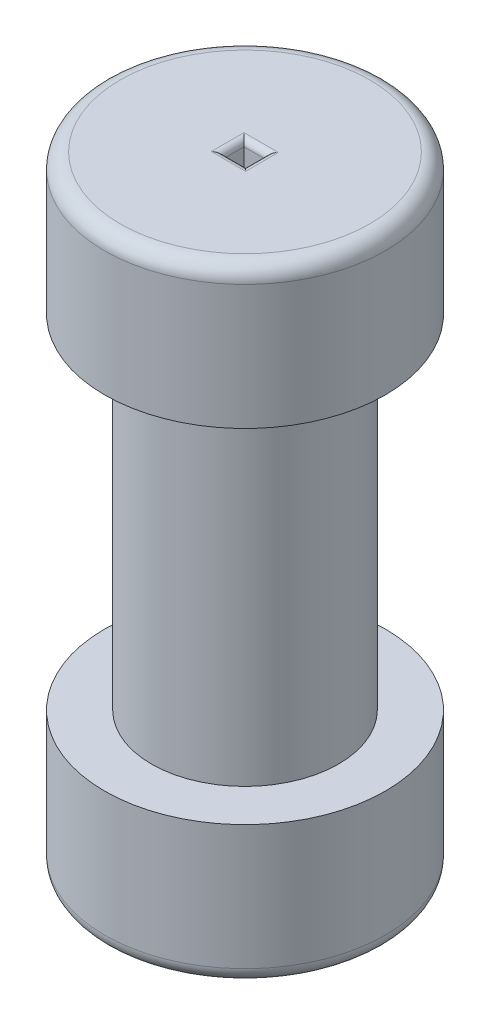
ISO-10303-21;
HEADER;
FILE_DESCRIPTION(('STEP AP214'),'2;1');
FILE_NAME('part.step','',(''),(''),'','','');
FILE_SCHEMA(('AUTOMOTIVE_DESIGN { 1 0 10303 214 1 1 1 1 }'));
ENDSEC;
DATA;
#1=APPLICATION_CONTEXT('core data for automotive mechanical design processes');
#2=APPLICATION_PROTOCOL_DEFINITION('international standard','automotive_design',2000,#1);
#3=PRODUCT_CONTEXT('',#1,'mechanical');
#4=PRODUCT('Part','Part','',(#3));
#5=PRODUCT_RELATED_PRODUCT_CATEGORY('part','',(#4));
#6=PRODUCT_DEFINITION_FORMATION('','',#4);
#7=PRODUCT_DEFINITION_CONTEXT('part definition',#1,'design');
#8=PRODUCT_DEFINITION('design','',#6,#7);
#9=PRODUCT_DEFINITION_SHAPE('','',#8);
#10=(LENGTH_UNIT() NAMED_UNIT(*) SI_UNIT(.MILLI.,.METRE.));
#11=(NAMED_UNIT(*) PLANE_ANGLE_UNIT() SI_UNIT($,.RADIAN.));
#12=(NAMED_UNIT(*) SI_UNIT($,.STERADIAN.) SOLID_ANGLE_UNIT());
#13=UNCERTAINTY_MEASURE_WITH_UNIT(LENGTH_MEASURE(1.E-05),#10,'distance_accuracy_value','');
#14=(GEOMETRIC_REPRESENTATION_CONTEXT(3) GLOBAL_UNCERTAINTY_ASSIGNED_CONTEXT((#13)) GLOBAL_UNIT_ASSIGNED_CONTEXT((#10,
#11,#12)) REPRESENTATION_CONTEXT('',''));
#15=CARTESIAN_POINT('',(0.,0.,0.));
#16=DIRECTION('',(0.,0.,1.));
#17=DIRECTION('',(1.,0.,0.));
#18=AXIS2_PLACEMENT_3D('',#15,#16,#17);
#19=CARTESIAN_POINT('',(0.,22.86,0.));
#20=DIRECTION('',(0.,-1.,0.));
#21=DIRECTION('',(0.,0.,-1.));
#22=AXIS2_PLACEMENT_3D('',#19,#20,#21);
#23=CYLINDRICAL_SURFACE('',#22,22.86);
#24=CARTESIAN_POINT('',(0.,2.54,0.));
#25=DIRECTION('',(0.,1.,0.));
#26=DIRECTION('',(0.,0.,1.));
#27=AXIS2_PLACEMENT_3D('',#24,#25,#26);
#28=CIRCLE('',#27,22.86);
#29=CARTESIAN_POINT('',(0.,2.54,22.86));
#30=VERTEX_POINT('',#29);
#31=EDGE_CURVE('E219',#30,#30,#28,.T.);
#32=ORIENTED_EDGE('',*,*,#31,.T.);
#33=EDGE_LOOP('',(#32));
#34=FACE_BOUND('',#33,.T.);
#35=CARTESIAN_POINT('',(0.,22.86,0.));
#36=DIRECTION('',(0.,1.,0.));
#37=DIRECTION('',(0.,0.,1.));
#38=AXIS2_PLACEMENT_3D('',#35,#36,#37);
#39=CIRCLE('',#38,22.86);
#40=CARTESIAN_POINT('',(0.,22.86,22.86));
#41=VERTEX_POINT('',#40);
#42=EDGE_CURVE('E224',#41,#41,#39,.T.);
#43=ORIENTED_EDGE('',*,*,#42,.F.);
#44=EDGE_LOOP('',(#43));
#45=FACE_BOUND('',#44,.T.);
#46=ADVANCED_FACE('F45',(#34,#45),#23,.T.);
#47=CARTESIAN_POINT('',(0.,22.86,0.));
#48=DIRECTION('',(0.,1.,0.));
#49=DIRECTION('',(0.,0.,1.));
#50=AXIS2_PLACEMENT_3D('',#47,#48,#49);
#51=PLANE('',#50);
#52=CARTESIAN_POINT('',(0.,22.86,0.));
#53=DIRECTION('',(0.,1.,0.));
#54=DIRECTION('',(0.,0.,1.));
#55=AXIS2_PLACEMENT_3D('',#52,#53,#54);
#56=CIRCLE('',#55,15.24);
#57=CARTESIAN_POINT('',(0.,22.86,15.24));
#58=VERTEX_POINT('',#57);
#59=EDGE_CURVE('E223',#58,#58,#56,.T.);
#60=ORIENTED_EDGE('',*,*,#59,.F.);
#61=EDGE_LOOP('',(#60));
#62=FACE_BOUND('',#61,.T.);
#63=ORIENTED_EDGE('',*,*,#42,.T.);
#64=EDGE_LOOP('',(#63));
#65=FACE_BOUND('',#64,.T.);
#66=ADVANCED_FACE('F285',(#62,#65),#51,.T.);
#67=CARTESIAN_POINT('',(0.,0.,0.));
#68=DIRECTION('',(0.,1.,0.));
#69=DIRECTION('',(0.,0.,1.));
#70=AXIS2_PLACEMENT_3D('',#67,#68,#69);
#71=PLANE('',#70);
#72=DIRECTION('',(0.,0.,1.));
#73=VECTOR('',#72,1.);
#74=CARTESIAN_POINT('',(-2.8,0.,0.));
#75=LINE('',#74,#73);
#76=CARTESIAN_POINT('',(-2.8,0.,-2.64));
#77=VERTEX_POINT('',#76);
#78=CARTESIAN_POINT('',(-2.8,0.,2.7));
#79=VERTEX_POINT('',#78);
#80=EDGE_CURVE('E125',#77,#79,#75,.T.);
#81=ORIENTED_EDGE('',*,*,#80,.T.);
#82=DIRECTION('',(1.,0.,0.));
#83=VECTOR('',#82,1.);
#84=CARTESIAN_POINT('',(0.,0.,2.7));
#85=LINE('',#84,#83);
#86=CARTESIAN_POINT('',(2.8,0.,2.7));
#87=VERTEX_POINT('',#86);
#88=EDGE_CURVE('E120',#79,#87,#85,.T.);
#89=ORIENTED_EDGE('',*,*,#88,.T.);
#90=DIRECTION('',(0.,0.,-1.));
#91=VECTOR('',#90,1.);
#92=CARTESIAN_POINT('',(2.8,0.,0.));
#93=LINE('',#92,#91);
#94=CARTESIAN_POINT('',(2.8,0.,-2.64));
#95=VERTEX_POINT('',#94);
#96=EDGE_CURVE('E113',#87,#95,#93,.T.);
#97=ORIENTED_EDGE('',*,*,#96,.T.);
#98=DIRECTION('',(-1.,0.,0.));
#99=VECTOR('',#98,1.);
#100=CARTESIAN_POINT('',(0.,0.,-2.64));
#101=LINE('',#100,#99);
#102=EDGE_CURVE('E117',#95,#77,#101,.T.);
#103=ORIENTED_EDGE('',*,*,#102,.T.);
#104=EDGE_LOOP('',(#81,#89,#97,#103));
#105=FACE_BOUND('',#104,.T.);
#106=CARTESIAN_POINT('',(0.,0.,0.));
#107=DIRECTION('',(0.,1.,0.));
#108=DIRECTION('',(0.,0.,1.));
#109=AXIS2_PLACEMENT_3D('',#106,#107,#108);
#110=CIRCLE('',#109,20.32);
#111=CARTESIAN_POINT('',(0.,0.,20.32));
#112=VERTEX_POINT('',#111);
#113=EDGE_CURVE('E215',#112,#112,#110,.F.);
#114=ORIENTED_EDGE('',*,*,#113,.T.);
#115=EDGE_LOOP('',(#114));
#116=FACE_BOUND('',#115,.T.);
#117=ADVANCED_FACE('F115',(#105,#116),#71,.F.);
#118=CARTESIAN_POINT('',(0.,78.74,0.));
#119=DIRECTION('',(0.,-1.,0.));
#120=DIRECTION('',(0.,0.,-1.));
#121=AXIS2_PLACEMENT_3D('',#118,#119,#120);
#122=CYLINDRICAL_SURFACE('',#121,15.24);
#123=CARTESIAN_POINT('',(0.,78.74,0.));
#124=DIRECTION('',(0.,1.,0.));
#125=DIRECTION('',(0.,0.,1.));
#126=AXIS2_PLACEMENT_3D('',#123,#124,#125);
#127=CIRCLE('',#126,15.24);
#128=CARTESIAN_POINT('',(0.,78.74,15.24));
#129=VERTEX_POINT('',#128);
#130=EDGE_CURVE('E228',#129,#129,#127,.T.);
#131=ORIENTED_EDGE('',*,*,#130,.F.);
#132=EDGE_LOOP('',(#131));
#133=FACE_BOUND('',#132,.T.);
#134=ORIENTED_EDGE('',*,*,#59,.T.);
#135=EDGE_LOOP('',(#134));
#136=FACE_BOUND('',#135,.T.);
#137=ADVANCED_FACE('F322',(#133,#136),#122,.T.);
#138=CARTESIAN_POINT('',(0.,101.6,0.));
#139=DIRECTION('',(0.,-1.,0.));
#140=DIRECTION('',(0.,0.,-1.));
#141=AXIS2_PLACEMENT_3D('',#138,#139,#140);
#142=CYLINDRICAL_SURFACE('',#141,22.86);
#143=CARTESIAN_POINT('',(0.,99.06,0.));
#144=DIRECTION('',(0.,1.,0.));
#145=DIRECTION('',(0.,0.,1.));
#146=AXIS2_PLACEMENT_3D('',#143,#144,#145);
#147=CIRCLE('',#146,22.86);
#148=CARTESIAN_POINT('',(0.,99.06,22.86));
#149=VERTEX_POINT('',#148);
#150=EDGE_CURVE('E137',#149,#149,#147,.F.);
#151=ORIENTED_EDGE('',*,*,#150,.T.);
#152=EDGE_LOOP('',(#151));
#153=FACE_BOUND('',#152,.T.);
#154=CARTESIAN_POINT('',(0.,78.74,0.));
#155=DIRECTION('',(0.,1.,0.));
#156=DIRECTION('',(0.,0.,1.));
#157=AXIS2_PLACEMENT_3D('',#154,#155,#156);
#158=CIRCLE('',#157,22.86);
#159=CARTESIAN_POINT('',(0.,78.74,22.86));
#160=VERTEX_POINT('',#159);
#161=EDGE_CURVE('E235',#160,#160,#158,.T.);
#162=ORIENTED_EDGE('',*,*,#161,.T.);
#163=EDGE_LOOP('',(#162));
#164=FACE_BOUND('',#163,.T.);
#165=ADVANCED_FACE('F316',(#153,#164),#142,.T.);
#166=CARTESIAN_POINT('',(0.,101.6,0.));
#167=DIRECTION('',(0.,1.,0.));
#168=DIRECTION('',(0.,0.,1.));
#169=AXIS2_PLACEMENT_3D('',#166,#167,#168);
#170=PLANE('',#169);
#171=DIRECTION('',(0.,0.,-1.));
#172=VECTOR('',#171,1.);
#173=CARTESIAN_POINT('',(2.8,101.6,1.7));
#174=LINE('',#173,#172);
#175=CARTESIAN_POINT('',(2.8,101.6,-2.64));
#176=VERTEX_POINT('',#175);
#177=CARTESIAN_POINT('',(2.8,101.6,2.7));
#178=VERTEX_POINT('',#177);
#179=EDGE_CURVE('E55',#176,#178,#174,.F.);
#180=ORIENTED_EDGE('',*,*,#179,.T.);
#181=DIRECTION('',(1.,0.,0.));
#182=VECTOR('',#181,1.);
#183=CARTESIAN_POINT('',(-1.8,101.6,2.7));
#184=LINE('',#183,#182);
#185=CARTESIAN_POINT('',(-2.8,101.6,2.7));
#186=VERTEX_POINT('',#185);
#187=EDGE_CURVE('E11',#178,#186,#184,.F.);
#188=ORIENTED_EDGE('',*,*,#187,.T.);
#189=DIRECTION('',(0.,0.,1.));
#190=VECTOR('',#189,1.);
#191=CARTESIAN_POINT('',(-2.8,101.6,-1.64));
#192=LINE('',#191,#190);
#193=CARTESIAN_POINT('',(-2.8,101.6,-2.64));
#194=VERTEX_POINT('',#193);
#195=EDGE_CURVE('E173',#186,#194,#192,.F.);
#196=ORIENTED_EDGE('',*,*,#195,.T.);
#197=DIRECTION('',(-1.,0.,0.));
#198=VECTOR('',#197,1.);
#199=CARTESIAN_POINT('',(1.8,101.6,-2.64));
#200=LINE('',#199,#198);
#201=EDGE_CURVE('E176',#194,#176,#200,.F.);
#202=ORIENTED_EDGE('',*,*,#201,.T.);
#203=EDGE_LOOP('',(#180,#188,#196,#202));
#204=FACE_BOUND('',#203,.T.);
#205=CARTESIAN_POINT('',(0.,101.6,0.));
#206=DIRECTION('',(0.,1.,0.));
#207=DIRECTION('',(0.,0.,1.));
#208=AXIS2_PLACEMENT_3D('',#205,#206,#207);
#209=CIRCLE('',#208,20.32);
#210=CARTESIAN_POINT('',(0.,101.6,20.32));
#211=VERTEX_POINT('',#210);
#212=EDGE_CURVE('E211',#211,#211,#209,.T.);
#213=ORIENTED_EDGE('',*,*,#212,.T.);
#214=EDGE_LOOP('',(#213));
#215=FACE_BOUND('',#214,.T.);
#216=ADVANCED_FACE('F314',(#204,#215),#170,.T.);
#217=CARTESIAN_POINT('',(0.,78.74,0.));
#218=DIRECTION('',(0.,1.,0.));
#219=DIRECTION('',(0.,0.,1.));
#220=AXIS2_PLACEMENT_3D('',#217,#218,#219);
#221=PLANE('',#220);
#222=ORIENTED_EDGE('',*,*,#130,.T.);
#223=EDGE_LOOP('',(#222));
#224=FACE_BOUND('',#223,.T.);
#225=ORIENTED_EDGE('',*,*,#161,.F.);
#226=EDGE_LOOP('',(#225));
#227=FACE_BOUND('',#226,.T.);
#228=ADVANCED_FACE('F301',(#224,#227),#221,.F.);
#229=CARTESIAN_POINT('',(0.,2.54,0.));
#230=DIRECTION('',(0.,1.,0.));
#231=DIRECTION('',(0.,0.,1.));
#232=AXIS2_PLACEMENT_3D('',#229,#230,#231);
#233=TOROIDAL_SURFACE('',#232,20.32,2.54);
#234=ORIENTED_EDGE('',*,*,#113,.F.);
#235=EDGE_LOOP('',(#234));
#236=FACE_BOUND('',#235,.T.);
#237=ORIENTED_EDGE('',*,*,#31,.F.);
#238=EDGE_LOOP('',(#237));
#239=FACE_BOUND('',#238,.T.);
#240=ADVANCED_FACE('F298',(#236,#239),#233,.T.);
#241=CARTESIAN_POINT('',(0.,99.06,0.));
#242=DIRECTION('',(0.,1.,0.));
#243=DIRECTION('',(0.,0.,1.));
#244=AXIS2_PLACEMENT_3D('',#241,#242,#243);
#245=TOROIDAL_SURFACE('',#244,20.32,2.54);
#246=ORIENTED_EDGE('',*,*,#150,.F.);
#247=EDGE_LOOP('',(#246));
#248=FACE_BOUND('',#247,.T.);
#249=ORIENTED_EDGE('',*,*,#212,.F.);
#250=EDGE_LOOP('',(#249));
#251=FACE_BOUND('',#250,.T.);
#252=ADVANCED_FACE('F300',(#248,#251),#245,.T.);
#253=CARTESIAN_POINT('',(1.8,0.,-1.64));
#254=DIRECTION('',(0.,0.,-1.));
#255=DIRECTION('',(-1.,0.,0.));
#256=AXIS2_PLACEMENT_3D('',#253,#254,#255);
#257=PLANE('',#256);
#258=DIRECTION('',(0.,1.,0.));
#259=VECTOR('',#258,1.);
#260=CARTESIAN_POINT('',(-1.8,0.,-1.64));
#261=LINE('',#260,#259);
#262=CARTESIAN_POINT('',(-1.8,1.,-1.64));
#263=VERTEX_POINT('',#262);
#264=CARTESIAN_POINT('',(-1.8,100.6,-1.64));
#265=VERTEX_POINT('',#264);
#266=EDGE_CURVE('E239',#263,#265,#261,.T.);
#267=ORIENTED_EDGE('',*,*,#266,.F.);
#268=DIRECTION('',(-1.,0.,0.));
#269=VECTOR('',#268,1.);
#270=CARTESIAN_POINT('',(1.8,1.,-1.64));
#271=LINE('',#270,#269);
#272=CARTESIAN_POINT('',(1.8,1.,-1.64));
#273=VERTEX_POINT('',#272);
#274=EDGE_CURVE('E179',#263,#273,#271,.F.);
#275=ORIENTED_EDGE('',*,*,#274,.T.);
#276=DIRECTION('',(0.,1.,0.));
#277=VECTOR('',#276,1.);
#278=CARTESIAN_POINT('',(1.8,0.,-1.64));
#279=LINE('',#278,#277);
#280=CARTESIAN_POINT('',(1.8,100.6,-1.64));
#281=VERTEX_POINT('',#280);
#282=EDGE_CURVE('E247',#273,#281,#279,.T.);
#283=ORIENTED_EDGE('',*,*,#282,.T.);
#284=DIRECTION('',(-1.,0.,0.));
#285=VECTOR('',#284,1.);
#286=CARTESIAN_POINT('',(-1.8,100.6,-1.64));
#287=LINE('',#286,#285);
#288=EDGE_CURVE('E182',#281,#265,#287,.T.);
#289=ORIENTED_EDGE('',*,*,#288,.T.);
#290=EDGE_LOOP('',(#267,#275,#283,#289));
#291=FACE_BOUND('',#290,.T.);
#292=ADVANCED_FACE('F271',(#291),#257,.F.);
#293=CARTESIAN_POINT('',(1.8,0.,1.7));
#294=DIRECTION('',(1.,0.,0.));
#295=DIRECTION('',(0.,0.,-1.));
#296=AXIS2_PLACEMENT_3D('',#293,#294,#295);
#297=PLANE('',#296);
#298=ORIENTED_EDGE('',*,*,#282,.F.);
#299=DIRECTION('',(0.,0.,-1.));
#300=VECTOR('',#299,1.);
#301=CARTESIAN_POINT('',(1.8,1.,1.7));
#302=LINE('',#301,#300);
#303=CARTESIAN_POINT('',(1.8,1.,1.7));
#304=VERTEX_POINT('',#303);
#305=EDGE_CURVE('E140',#273,#304,#302,.F.);
#306=ORIENTED_EDGE('',*,*,#305,.T.);
#307=DIRECTION('',(0.,1.,0.));
#308=VECTOR('',#307,1.);
#309=CARTESIAN_POINT('',(1.8,0.,1.7));
#310=LINE('',#309,#308);
#311=CARTESIAN_POINT('',(1.8,100.6,1.7));
#312=VERTEX_POINT('',#311);
#313=EDGE_CURVE('E243',#304,#312,#310,.T.);
#314=ORIENTED_EDGE('',*,*,#313,.T.);
#315=DIRECTION('',(0.,0.,-1.));
#316=VECTOR('',#315,1.);
#317=CARTESIAN_POINT('',(1.8,100.6,-1.64));
#318=LINE('',#317,#316);
#319=EDGE_CURVE('E187',#312,#281,#318,.T.);
#320=ORIENTED_EDGE('',*,*,#319,.T.);
#321=EDGE_LOOP('',(#298,#306,#314,#320));
#322=FACE_BOUND('',#321,.T.);
#323=ADVANCED_FACE('F270',(#322),#297,.F.);
#324=CARTESIAN_POINT('',(-1.8,0.,1.7));
#325=DIRECTION('',(0.,0.,1.));
#326=DIRECTION('',(1.,0.,0.));
#327=AXIS2_PLACEMENT_3D('',#324,#325,#326);
#328=PLANE('',#327);
#329=ORIENTED_EDGE('',*,*,#313,.F.);
#330=DIRECTION('',(1.,0.,0.));
#331=VECTOR('',#330,1.);
#332=CARTESIAN_POINT('',(-1.8,1.,1.7));
#333=LINE('',#332,#331);
#334=CARTESIAN_POINT('',(-1.8,1.,1.7));
#335=VERTEX_POINT('',#334);
#336=EDGE_CURVE('E196',#304,#335,#333,.F.);
#337=ORIENTED_EDGE('',*,*,#336,.T.);
#338=DIRECTION('',(0.,1.,0.));
#339=VECTOR('',#338,1.);
#340=CARTESIAN_POINT('',(-1.8,0.,1.7));
#341=LINE('',#340,#339);
#342=CARTESIAN_POINT('',(-1.8,100.6,1.7));
#343=VERTEX_POINT('',#342);
#344=EDGE_CURVE('E146',#335,#343,#341,.T.);
#345=ORIENTED_EDGE('',*,*,#344,.T.);
#346=DIRECTION('',(1.,0.,0.));
#347=VECTOR('',#346,1.);
#348=CARTESIAN_POINT('',(1.8,100.6,1.7));
#349=LINE('',#348,#347);
#350=EDGE_CURVE('E200',#343,#312,#349,.T.);
#351=ORIENTED_EDGE('',*,*,#350,.T.);
#352=EDGE_LOOP('',(#329,#337,#345,#351));
#353=FACE_BOUND('',#352,.T.);
#354=ADVANCED_FACE('F267',(#353),#328,.F.);
#355=CARTESIAN_POINT('',(-1.8,0.,0.0300000000000004));
#356=DIRECTION('',(-1.,0.,0.));
#357=DIRECTION('',(0.,0.,1.));
#358=AXIS2_PLACEMENT_3D('',#355,#356,#357);
#359=PLANE('',#358);
#360=ORIENTED_EDGE('',*,*,#344,.F.);
#361=DIRECTION('',(0.,0.,1.));
#362=VECTOR('',#361,1.);
#363=CARTESIAN_POINT('',(-1.8,1.,0.0300000000000004));
#364=LINE('',#363,#362);
#365=EDGE_CURVE('E190',#335,#263,#364,.F.);
#366=ORIENTED_EDGE('',*,*,#365,.T.);
#367=ORIENTED_EDGE('',*,*,#266,.T.);
#368=DIRECTION('',(0.,0.,1.));
#369=VECTOR('',#368,1.);
#370=CARTESIAN_POINT('',(-1.8,100.6,1.7));
#371=LINE('',#370,#369);
#372=EDGE_CURVE('E193',#265,#343,#371,.T.);
#373=ORIENTED_EDGE('',*,*,#372,.T.);
#374=EDGE_LOOP('',(#360,#366,#367,#373));
#375=FACE_BOUND('',#374,.T.);
#376=ADVANCED_FACE('F256',(#375),#359,.F.);
#377=CARTESIAN_POINT('',(0.,1.,-2.64));
#378=DIRECTION('',(-1.,0.,0.));
#379=DIRECTION('',(0.,0.,1.));
#380=AXIS2_PLACEMENT_3D('',#377,#378,#379);
#381=CYLINDRICAL_SURFACE('',#380,1.);
#382=CARTESIAN_POINT('',(2.8,1.,-2.64));
#383=DIRECTION('',(-0.707106781186548,0.,-0.707106781186547));
#384=DIRECTION('',(0.707106781186547,0.,-0.707106781186548));
#385=AXIS2_PLACEMENT_3D('',#382,#383,#384);
#386=ELLIPSE('',#385,1.4142135623731,1.);
#387=EDGE_CURVE('E131',#273,#95,#386,.F.);
#388=ORIENTED_EDGE('',*,*,#387,.F.);
#389=ORIENTED_EDGE('',*,*,#274,.F.);
#390=CARTESIAN_POINT('',(-2.8,1.,-2.64));
#391=DIRECTION('',(-0.707106781186547,0.,0.707106781186548));
#392=DIRECTION('',(0.707106781186548,0.,0.707106781186547));
#393=AXIS2_PLACEMENT_3D('',#390,#391,#392);
#394=ELLIPSE('',#393,1.41421356237309,1.);
#395=EDGE_CURVE('E134',#77,#263,#394,.T.);
#396=ORIENTED_EDGE('',*,*,#395,.F.);
#397=ORIENTED_EDGE('',*,*,#102,.F.);
#398=EDGE_LOOP('',(#388,#389,#396,#397));
#399=FACE_BOUND('',#398,.T.);
#400=ADVANCED_FACE('F129',(#399),#381,.T.);
#401=CARTESIAN_POINT('',(-2.8,1.,0.));
#402=DIRECTION('',(0.,0.,1.));
#403=DIRECTION('',(1.,0.,0.));
#404=AXIS2_PLACEMENT_3D('',#401,#402,#403);
#405=CYLINDRICAL_SURFACE('',#404,1.);
#406=ORIENTED_EDGE('',*,*,#395,.T.);
#407=ORIENTED_EDGE('',*,*,#365,.F.);
#408=CARTESIAN_POINT('',(-2.8,1.,2.7));
#409=DIRECTION('',(0.707106781186548,0.,0.707106781186547));
#410=DIRECTION('',(0.707106781186547,0.,-0.707106781186548));
#411=AXIS2_PLACEMENT_3D('',#408,#409,#410);
#412=ELLIPSE('',#411,1.4142135623731,1.);
#413=EDGE_CURVE('E142',#79,#335,#412,.T.);
#414=ORIENTED_EDGE('',*,*,#413,.F.);
#415=ORIENTED_EDGE('',*,*,#80,.F.);
#416=EDGE_LOOP('',(#406,#407,#414,#415));
#417=FACE_BOUND('',#416,.T.);
#418=ADVANCED_FACE('F273',(#417),#405,.T.);
#419=CARTESIAN_POINT('',(2.8,1.,0.));
#420=DIRECTION('',(0.,0.,-1.));
#421=DIRECTION('',(-1.,0.,0.));
#422=AXIS2_PLACEMENT_3D('',#419,#420,#421);
#423=CYLINDRICAL_SURFACE('',#422,1.);
#424=ORIENTED_EDGE('',*,*,#387,.T.);
#425=ORIENTED_EDGE('',*,*,#96,.F.);
#426=CARTESIAN_POINT('',(2.8,1.,2.7));
#427=DIRECTION('',(0.707106781186547,0.,-0.707106781186548));
#428=DIRECTION('',(0.707106781186548,0.,0.707106781186547));
#429=AXIS2_PLACEMENT_3D('',#426,#427,#428);
#430=ELLIPSE('',#429,1.41421356237309,1.);
#431=EDGE_CURVE('E148',#304,#87,#430,.F.);
#432=ORIENTED_EDGE('',*,*,#431,.F.);
#433=ORIENTED_EDGE('',*,*,#305,.F.);
#434=EDGE_LOOP('',(#424,#425,#432,#433));
#435=FACE_BOUND('',#434,.T.);
#436=ADVANCED_FACE('F139',(#435),#423,.T.);
#437=CARTESIAN_POINT('',(0.,1.,2.7));
#438=DIRECTION('',(1.,0.,0.));
#439=DIRECTION('',(0.,0.,-1.));
#440=AXIS2_PLACEMENT_3D('',#437,#438,#439);
#441=CYLINDRICAL_SURFACE('',#440,1.);
#442=ORIENTED_EDGE('',*,*,#413,.T.);
#443=ORIENTED_EDGE('',*,*,#336,.F.);
#444=ORIENTED_EDGE('',*,*,#431,.T.);
#445=ORIENTED_EDGE('',*,*,#88,.F.);
#446=EDGE_LOOP('',(#442,#443,#444,#445));
#447=FACE_BOUND('',#446,.T.);
#448=ADVANCED_FACE('F275',(#447),#441,.T.);
#449=CARTESIAN_POINT('',(1.8,100.6,-2.64));
#450=DIRECTION('',(1.,0.,0.));
#451=DIRECTION('',(0.,0.,-1.));
#452=AXIS2_PLACEMENT_3D('',#449,#450,#451);
#453=CYLINDRICAL_SURFACE('',#452,1.);
#454=CARTESIAN_POINT('',(2.8,100.6,-2.64));
#455=DIRECTION('',(0.707106781186548,0.,0.707106781186547));
#456=DIRECTION('',(-0.707106781186547,0.,0.707106781186548));
#457=AXIS2_PLACEMENT_3D('',#454,#455,#456);
#458=ELLIPSE('',#457,1.4142135623731,1.);
#459=EDGE_CURVE('E156',#176,#281,#458,.T.);
#460=ORIENTED_EDGE('',*,*,#459,.F.);
#461=ORIENTED_EDGE('',*,*,#201,.F.);
#462=CARTESIAN_POINT('',(-2.8,100.6,-2.64));
#463=DIRECTION('',(0.707106781186547,0.,-0.707106781186548));
#464=DIRECTION('',(-0.707106781186548,0.,-0.707106781186547));
#465=AXIS2_PLACEMENT_3D('',#462,#463,#464);
#466=ELLIPSE('',#465,1.41421356237309,1.);
#467=EDGE_CURVE('E49',#265,#194,#466,.F.);
#468=ORIENTED_EDGE('',*,*,#467,.F.);
#469=ORIENTED_EDGE('',*,*,#288,.F.);
#470=EDGE_LOOP('',(#460,#461,#468,#469));
#471=FACE_BOUND('',#470,.T.);
#472=ADVANCED_FACE('F47',(#471),#453,.T.);
#473=CARTESIAN_POINT('',(-2.8,100.6,0.0300000000000005));
#474=DIRECTION('',(0.,0.,-1.));
#475=DIRECTION('',(-1.,0.,0.));
#476=AXIS2_PLACEMENT_3D('',#473,#474,#475);
#477=CYLINDRICAL_SURFACE('',#476,1.);
#478=ORIENTED_EDGE('',*,*,#467,.T.);
#479=ORIENTED_EDGE('',*,*,#195,.F.);
#480=CARTESIAN_POINT('',(-2.8,100.6,2.7));
#481=DIRECTION('',(-0.707106781186548,0.,-0.707106781186547));
#482=DIRECTION('',(-0.707106781186547,0.,0.707106781186548));
#483=AXIS2_PLACEMENT_3D('',#480,#481,#482);
#484=ELLIPSE('',#483,1.4142135623731,1.);
#485=EDGE_CURVE('E68',#343,#186,#484,.F.);
#486=ORIENTED_EDGE('',*,*,#485,.F.);
#487=ORIENTED_EDGE('',*,*,#372,.F.);
#488=EDGE_LOOP('',(#478,#479,#486,#487));
#489=FACE_BOUND('',#488,.T.);
#490=ADVANCED_FACE('F262',(#489),#477,.T.);
#491=CARTESIAN_POINT('',(2.8,100.6,1.7));
#492=DIRECTION('',(0.,0.,1.));
#493=DIRECTION('',(1.,0.,0.));
#494=AXIS2_PLACEMENT_3D('',#491,#492,#493);
#495=CYLINDRICAL_SURFACE('',#494,1.);
#496=ORIENTED_EDGE('',*,*,#459,.T.);
#497=ORIENTED_EDGE('',*,*,#319,.F.);
#498=CARTESIAN_POINT('',(2.8,100.6,2.7));
#499=DIRECTION('',(-0.707106781186547,0.,0.707106781186548));
#500=DIRECTION('',(-0.707106781186548,0.,-0.707106781186547));
#501=AXIS2_PLACEMENT_3D('',#498,#499,#500);
#502=ELLIPSE('',#501,1.41421356237309,1.);
#503=EDGE_CURVE('E152',#178,#312,#502,.T.);
#504=ORIENTED_EDGE('',*,*,#503,.F.);
#505=ORIENTED_EDGE('',*,*,#179,.F.);
#506=EDGE_LOOP('',(#496,#497,#504,#505));
#507=FACE_BOUND('',#506,.T.);
#508=ADVANCED_FACE('F449',(#507),#495,.T.);
#509=CARTESIAN_POINT('',(-1.8,100.6,2.7));
#510=DIRECTION('',(-1.,0.,0.));
#511=DIRECTION('',(0.,0.,1.));
#512=AXIS2_PLACEMENT_3D('',#509,#510,#511);
#513=CYLINDRICAL_SURFACE('',#512,1.);
#514=ORIENTED_EDGE('',*,*,#485,.T.);
#515=ORIENTED_EDGE('',*,*,#187,.F.);
#516=ORIENTED_EDGE('',*,*,#503,.T.);
#517=ORIENTED_EDGE('',*,*,#350,.F.);
#518=EDGE_LOOP('',(#514,#515,#516,#517));
#519=FACE_BOUND('',#518,.T.);
#520=ADVANCED_FACE('F263',(#519),#513,.T.);
#521=CLOSED_SHELL('',(#46,#66,#117,#137,#165,#216,#228,#240,#252,#292,#323,#354,#376,#400,#418,
#436,#448,#472,#490,#508,#520));
#522=MANIFOLD_SOLID_BREP('B2',#521);
#523=ADVANCED_BREP_SHAPE_REPRESENTATION('',(#18,#522),#14);
#524=SHAPE_DEFINITION_REPRESENTATION(#9,#523);
ENDSEC;
END-ISO-10303-21;
